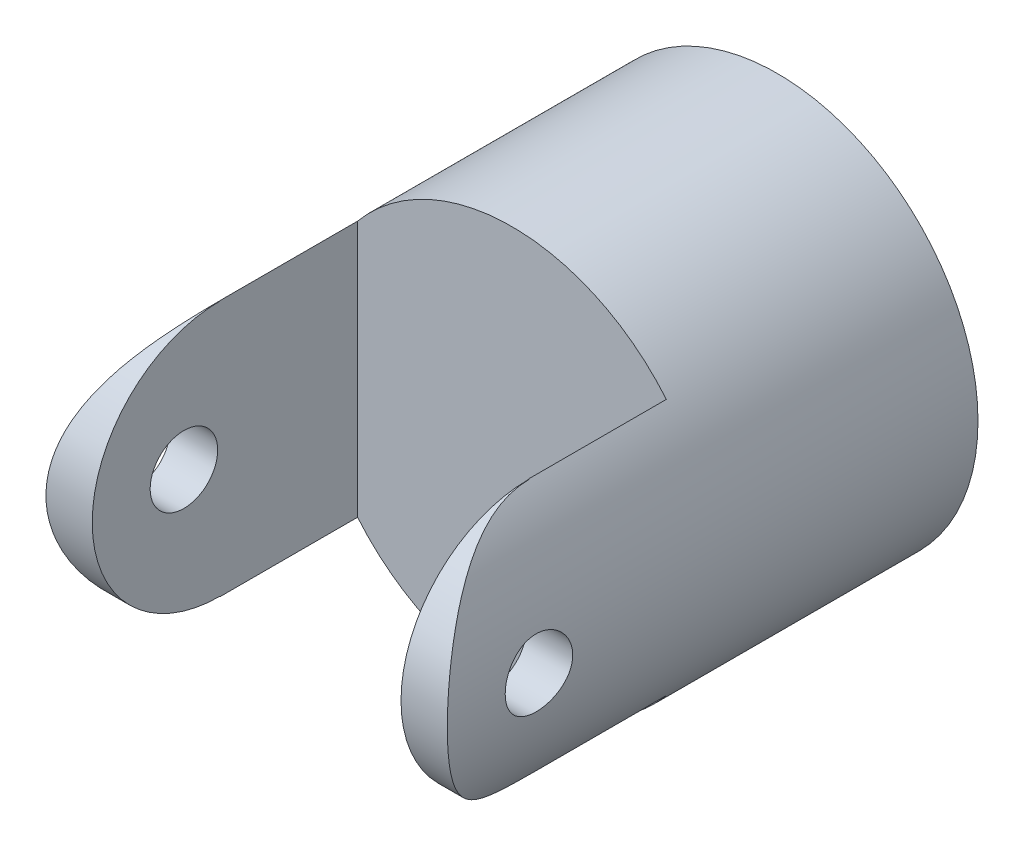
ISO-10303-21;
HEADER;
FILE_DESCRIPTION(('STEP AP214'),'2;1');
FILE_NAME('part.step','',(''),(''),'','','');
FILE_SCHEMA(('AUTOMOTIVE_DESIGN { 1 0 10303 214 1 1 1 1 }'));
ENDSEC;
DATA;
#1=APPLICATION_CONTEXT('core data for automotive mechanical design processes');
#2=APPLICATION_PROTOCOL_DEFINITION('international standard','automotive_design',2000,#1);
#3=PRODUCT_CONTEXT('',#1,'mechanical');
#4=PRODUCT('Part','Part','',(#3));
#5=PRODUCT_RELATED_PRODUCT_CATEGORY('part','',(#4));
#6=PRODUCT_DEFINITION_FORMATION('','',#4);
#7=PRODUCT_DEFINITION_CONTEXT('part definition',#1,'design');
#8=PRODUCT_DEFINITION('design','',#6,#7);
#9=PRODUCT_DEFINITION_SHAPE('','',#8);
#10=(LENGTH_UNIT() NAMED_UNIT(*) SI_UNIT(.MILLI.,.METRE.));
#11=(NAMED_UNIT(*) PLANE_ANGLE_UNIT() SI_UNIT($,.RADIAN.));
#12=(NAMED_UNIT(*) SI_UNIT($,.STERADIAN.) SOLID_ANGLE_UNIT());
#13=UNCERTAINTY_MEASURE_WITH_UNIT(LENGTH_MEASURE(1.E-05),#10,'distance_accuracy_value','');
#14=(GEOMETRIC_REPRESENTATION_CONTEXT(3) GLOBAL_UNCERTAINTY_ASSIGNED_CONTEXT((#13)) GLOBAL_UNIT_ASSIGNED_CONTEXT((#10,
#11,#12)) REPRESENTATION_CONTEXT('',''));
#15=CARTESIAN_POINT('',(0.,0.,0.));
#16=DIRECTION('',(0.,0.,1.));
#17=DIRECTION('',(1.,0.,0.));
#18=AXIS2_PLACEMENT_3D('',#15,#16,#17);
#19=CARTESIAN_POINT('',(0.,0.,11.));
#20=DIRECTION('',(0.,0.,-1.));
#21=DIRECTION('',(-1.,0.,0.));
#22=AXIS2_PLACEMENT_3D('',#19,#20,#21);
#23=CYLINDRICAL_SURFACE('',#22,4.16);
#24=CARTESIAN_POINT('',(-4.16,0.,8.4));
#25=CARTESIAN_POINT('',(-4.1599993277621,0.0390239125747628,8.40000155977883));
#26=CARTESIAN_POINT('',(-4.15944517372982,0.0780689849075887,8.4032743076211));
#27=CARTESIAN_POINT('',(-4.15728790947244,0.155063659220866,8.41627316724561));
#28=CARTESIAN_POINT('',(-4.1556838404645,0.193012226766777,8.42600517774355));
#29=CARTESIAN_POINT('',(-4.15160662871372,0.266688829253378,8.4516200868742));
#30=CARTESIAN_POINT('',(-4.1491342024726,0.302418666403529,8.46749791554888));
#31=CARTESIAN_POINT('',(-4.14359199062741,0.37070263465631,8.50494038987474));
#32=CARTESIAN_POINT('',(-4.14052227188301,0.403257120589323,8.52650439912268));
#33=CARTESIAN_POINT('',(-4.13409224580627,0.46458772784988,8.57493043107718));
#34=CARTESIAN_POINT('',(-4.13072963903228,0.493328446142046,8.6018369904627));
#35=CARTESIAN_POINT('',(-4.12411038432244,0.545909827859605,8.66008848698301));
#36=CARTESIAN_POINT('',(-4.12085374315079,0.569750178990013,8.69143370677385));
#37=CARTESIAN_POINT('',(-4.11479287163596,0.61199635700962,8.75791645283517));
#38=CARTESIAN_POINT('',(-4.11199161196014,0.630367102184491,8.79307656609853));
#39=CARTESIAN_POINT('',(-4.10719060804984,0.660928230525133,8.86603863677661));
#40=CARTESIAN_POINT('',(-4.10519080860076,0.673119039457476,8.90384041198986));
#41=CARTESIAN_POINT('',(-4.1022420557679,0.69086254711526,8.98063721227013));
#42=CARTESIAN_POINT('',(-4.10128342559077,0.696476412201096,9.01961772655558));
#43=CARTESIAN_POINT('',(-4.10049628461693,0.701096337075264,9.09797832626149));
#44=CARTESIAN_POINT('',(-4.10066769229779,0.700102873524991,9.13735838265381));
#45=CARTESIAN_POINT('',(-4.1021124270041,0.691586147504626,9.21496310071234));
#46=CARTESIAN_POINT('',(-4.10337414803079,0.68413165787628,9.25319555739738));
#47=CARTESIAN_POINT('',(-4.10683917312899,0.663012441156744,9.32785926339887));
#48=CARTESIAN_POINT('',(-4.10904251006289,0.649347497319705,9.3642904498015));
#49=CARTESIAN_POINT('',(-4.11415501382972,0.616125724703303,9.43452301139548));
#50=CARTESIAN_POINT('',(-4.11706758136741,0.596540395518846,9.46831064744649));
#51=CARTESIAN_POINT('',(-4.12326802042378,0.552054037069553,9.53214599064827));
#52=CARTESIAN_POINT('',(-4.12655592279497,0.527152570671694,9.56219338992663));
#53=CARTESIAN_POINT('',(-4.13318753266133,0.47236637629369,9.61809336013438));
#54=CARTESIAN_POINT('',(-4.13653142033276,0.442422655344115,9.64388812707109));
#55=CARTESIAN_POINT('',(-4.14285984072331,0.37860130707401,9.69009584686133));
#56=CARTESIAN_POINT('',(-4.14584437104319,0.344723653491564,9.71050876378405));
#57=CARTESIAN_POINT('',(-4.1511221620187,0.273941318469586,9.74537883203141));
#58=CARTESIAN_POINT('',(-4.15341482187015,0.237034041344438,9.75983081098754));
#59=CARTESIAN_POINT('',(-4.1570457409022,0.161268902511086,9.78231477164084));
#60=CARTESIAN_POINT('',(-4.15838408148438,0.122411207472467,9.7903473009117));
#61=CARTESIAN_POINT('',(-4.15994460407459,0.0443464102274835,9.79968583493131));
#62=CARTESIAN_POINT('',(-4.16017995079601,0.00514905333311402,9.80107118148655));
#63=CARTESIAN_POINT('',(-4.1595440480163,-0.0729176566416257,9.79728764814687));
#64=CARTESIAN_POINT('',(-4.15867284194514,-0.111787022534712,9.79211902548208));
#65=CARTESIAN_POINT('',(-4.15592987811917,-0.187848839546986,9.77544026231971));
#66=CARTESIAN_POINT('',(-4.15406433008375,-0.225050161244746,9.76396946569981));
#67=CARTESIAN_POINT('',(-4.14954102253772,-0.297001702403252,9.73505395660164));
#68=CARTESIAN_POINT('',(-4.14688321783,-0.331751781884226,9.71760890329211));
#69=CARTESIAN_POINT('',(-4.14103756729968,-0.398158605742829,9.67705881107004));
#70=CARTESIAN_POINT('',(-4.13784517038284,-0.429784726143966,9.6539042896113));
#71=CARTESIAN_POINT('',(-4.13129802571993,-0.488730817092044,9.60266051997944));
#72=CARTESIAN_POINT('',(-4.12794326595238,-0.516050468145263,9.57457090600211));
#73=CARTESIAN_POINT('',(-4.12140684889181,-0.565902760035183,9.51389821469653));
#74=CARTESIAN_POINT('',(-4.11822739594523,-0.588381753338073,9.4812707822775));
#75=CARTESIAN_POINT('',(-4.11244297967972,-0.62753977754453,9.41265632538366));
#76=CARTESIAN_POINT('',(-4.10983799789771,-0.6442189948586,9.37666940893314));
#77=CARTESIAN_POINT('',(-4.1055140656407,-0.671224072877987,9.30250651334735));
#78=CARTESIAN_POINT('',(-4.10379141775969,-0.681576481831249,9.26434042661519));
#79=CARTESIAN_POINT('',(-4.10141798088834,-0.695717505748562,9.18677960808961));
#80=CARTESIAN_POINT('',(-4.10076709673286,-0.699506703481541,9.14738498569812));
#81=CARTESIAN_POINT('',(-4.10061503803945,-0.70039725202405,9.06902118945909));
#82=CARTESIAN_POINT('',(-4.10109934457034,-0.697583058792982,9.0300529778608));
#83=CARTESIAN_POINT('',(-4.10313125058084,-0.685529497995793,8.9531529833514));
#84=CARTESIAN_POINT('',(-4.10467884642083,-0.676290152422942,8.91522119689308));
#85=CARTESIAN_POINT('',(-4.10865739445353,-0.651681156604191,8.84150439132123));
#86=CARTESIAN_POINT('',(-4.11108727872626,-0.636318915311279,8.80571683758478));
#87=CARTESIAN_POINT('',(-4.11655762981038,-0.599908920025351,8.73721334940979));
#88=CARTESIAN_POINT('',(-4.1195981278615,-0.578860875120836,8.70449757225273));
#89=CARTESIAN_POINT('',(-4.12599307843607,-0.531375902753995,8.64263988511162));
#90=CARTESIAN_POINT('',(-4.12935088277078,-0.504876889588195,8.61354597472536));
#91=CARTESIAN_POINT('',(-4.13597549546759,-0.447373004296234,8.56018888428044));
#92=CARTESIAN_POINT('',(-4.13924228266241,-0.416367094283321,8.53592681999919));
#93=CARTESIAN_POINT('',(-4.14534350893309,-0.350469460605587,8.49276545794503));
#94=CARTESIAN_POINT('',(-4.14817473607019,-0.315551872090762,8.47390519165113));
#95=CARTESIAN_POINT('',(-4.15305458015047,-0.243010434628081,8.44234710952398));
#96=CARTESIAN_POINT('',(-4.15510397288708,-0.205389312618788,8.42964318151871));
#97=CARTESIAN_POINT('',(-4.15774414448338,-0.139687071677165,8.41350289017298));
#98=CARTESIAN_POINT('',(-4.15858555014462,-0.112002502096261,8.40844745508329));
#99=CARTESIAN_POINT('',(-4.15971371512396,-0.0562156106525505,8.40169547796901));
#100=CARTESIAN_POINT('',(-4.16000048428827,-0.028113296214703,8.39999887631656));
#101=CARTESIAN_POINT('',(-4.16,0.,8.4));
#102=B_SPLINE_CURVE_WITH_KNOTS('',3,(#24,#25,#26,#27,#28,#29,#30,#31,#32,#33,#34,#35,#36,#37,
#38,#39,#40,#41,#42,#43,#44,#45,#46,#47,#48,#49,#50,#51,#52,#53,#54,#55,#56,#57,#58,#59,#60,#61,
#62,#63,#64,#65,#66,#67,#68,#69,#70,#71,#72,#73,#74,#75,#76,#77,#78,#79,#80,#81,#82,#83,#84,#85,
#86,#87,#88,#89,#90,#91,#92,#93,#94,#95,#96,#97,#98,#99,#100,#101),.UNSPECIFIED.,.T.,.F.,(4,2,2,
2,2,2,2,2,2,2,2,2,2,2,2,2,2,2,2,2,2,2,2,2,2,2,2,2,2,2,2,2,2,2,2,2,2,2,4),(0.,0.116968971867076,
0.234044909163309,0.351024470460435,0.467990944836635,0.585976836802057,0.703970245548359,
0.82270491376216,0.941431400641504,1.05904472417866,1.1766495630277,1.29301774815333,
1.40938999485922,1.52633162208068,1.6432828688337,1.76171192378295,1.88014176937935,
1.99867416270379,2.11719644423498,2.23430044546542,2.35139985074145,2.46777638798962,
2.58415956562407,2.70158922800758,2.81902759831333,2.93770721667888,3.05638302021214,
3.17455736019733,3.29272120655945,3.409382015381,3.52604242487508,3.64256209702446,
3.75908773197823,3.87702241655098,3.99498430328666,4.11377819537088,4.23245390293315,
4.31672125379096,4.4009871086749),.UNSPECIFIED.);
#103=CARTESIAN_POINT('',(-4.16,0.,8.4));
#104=VERTEX_POINT('',#103);
#105=EDGE_CURVE('E132',#104,#104,#102,.T.);
#106=ORIENTED_EDGE('',*,*,#105,.T.);
#107=EDGE_LOOP('',(#106));
#108=FACE_BOUND('',#107,.T.);
#109=CARTESIAN_POINT('',(4.16,0.,8.4));
#110=CARTESIAN_POINT('',(4.1599993277621,-0.0390239125747628,8.40000155977883));
#111=CARTESIAN_POINT('',(4.15944517372982,-0.0780689849075887,8.4032743076211));
#112=CARTESIAN_POINT('',(4.15728790947244,-0.155063659220866,8.41627316724561));
#113=CARTESIAN_POINT('',(4.1556838404645,-0.193012226766777,8.42600517774355));
#114=CARTESIAN_POINT('',(4.15160662871372,-0.266688829253378,8.4516200868742));
#115=CARTESIAN_POINT('',(4.1491342024726,-0.302418666403529,8.46749791554888));
#116=CARTESIAN_POINT('',(4.14359199062741,-0.37070263465631,8.50494038987474));
#117=CARTESIAN_POINT('',(4.14052227188301,-0.403257120589323,8.52650439912268));
#118=CARTESIAN_POINT('',(4.13409224580627,-0.46458772784988,8.57493043107718));
#119=CARTESIAN_POINT('',(4.13072963903228,-0.493328446142046,8.6018369904627));
#120=CARTESIAN_POINT('',(4.12411038432244,-0.545909827859605,8.66008848698301));
#121=CARTESIAN_POINT('',(4.12085374315079,-0.569750178990013,8.69143370677385));
#122=CARTESIAN_POINT('',(4.11479287163596,-0.61199635700962,8.75791645283517));
#123=CARTESIAN_POINT('',(4.11199161196014,-0.630367102184491,8.79307656609853));
#124=CARTESIAN_POINT('',(4.10719060804984,-0.660928230525133,8.86603863677661));
#125=CARTESIAN_POINT('',(4.10519080860076,-0.673119039457476,8.90384041198986));
#126=CARTESIAN_POINT('',(4.1022420557679,-0.69086254711526,8.98063721227013));
#127=CARTESIAN_POINT('',(4.10128342559077,-0.696476412201096,9.01961772655558));
#128=CARTESIAN_POINT('',(4.10049628461693,-0.701096337075264,9.09797832626149));
#129=CARTESIAN_POINT('',(4.10066769229779,-0.700102873524991,9.13735838265381));
#130=CARTESIAN_POINT('',(4.1021124270041,-0.691586147504626,9.21496310071234));
#131=CARTESIAN_POINT('',(4.10337414803079,-0.68413165787628,9.25319555739738));
#132=CARTESIAN_POINT('',(4.10683917312899,-0.663012441156744,9.32785926339887));
#133=CARTESIAN_POINT('',(4.10904251006289,-0.649347497319705,9.3642904498015));
#134=CARTESIAN_POINT('',(4.11415501382972,-0.616125724703303,9.43452301139548));
#135=CARTESIAN_POINT('',(4.11706758136741,-0.596540395518846,9.46831064744649));
#136=CARTESIAN_POINT('',(4.12326802042378,-0.552054037069553,9.53214599064827));
#137=CARTESIAN_POINT('',(4.12655592279497,-0.527152570671694,9.56219338992663));
#138=CARTESIAN_POINT('',(4.13318753266133,-0.47236637629369,9.61809336013438));
#139=CARTESIAN_POINT('',(4.13653142033276,-0.442422655344115,9.64388812707109));
#140=CARTESIAN_POINT('',(4.14285984072331,-0.37860130707401,9.69009584686133));
#141=CARTESIAN_POINT('',(4.14584437104319,-0.344723653491564,9.71050876378405));
#142=CARTESIAN_POINT('',(4.1511221620187,-0.273941318469586,9.74537883203141));
#143=CARTESIAN_POINT('',(4.15341482187015,-0.237034041344438,9.75983081098754));
#144=CARTESIAN_POINT('',(4.1570457409022,-0.161268902511086,9.78231477164084));
#145=CARTESIAN_POINT('',(4.15838408148438,-0.122411207472467,9.7903473009117));
#146=CARTESIAN_POINT('',(4.15994460407459,-0.0443464102274835,9.79968583493131));
#147=CARTESIAN_POINT('',(4.16017995079601,-0.00514905333311402,9.80107118148655));
#148=CARTESIAN_POINT('',(4.1595440480163,0.0729176566416257,9.79728764814687));
#149=CARTESIAN_POINT('',(4.15867284194514,0.111787022534712,9.79211902548208));
#150=CARTESIAN_POINT('',(4.15592987811917,0.187848839546986,9.77544026231971));
#151=CARTESIAN_POINT('',(4.15406433008375,0.225050161244746,9.76396946569981));
#152=CARTESIAN_POINT('',(4.14954102253772,0.297001702403252,9.73505395660164));
#153=CARTESIAN_POINT('',(4.14688321783,0.331751781884226,9.71760890329211));
#154=CARTESIAN_POINT('',(4.14103756729968,0.398158605742829,9.67705881107004));
#155=CARTESIAN_POINT('',(4.13784517038284,0.429784726143966,9.6539042896113));
#156=CARTESIAN_POINT('',(4.13129802571993,0.488730817092044,9.60266051997944));
#157=CARTESIAN_POINT('',(4.12794326595238,0.516050468145263,9.57457090600211));
#158=CARTESIAN_POINT('',(4.12140684889181,0.565902760035183,9.51389821469653));
#159=CARTESIAN_POINT('',(4.11822739594523,0.588381753338073,9.4812707822775));
#160=CARTESIAN_POINT('',(4.11244297967972,0.62753977754453,9.41265632538366));
#161=CARTESIAN_POINT('',(4.10983799789771,0.6442189948586,9.37666940893314));
#162=CARTESIAN_POINT('',(4.1055140656407,0.671224072877987,9.30250651334735));
#163=CARTESIAN_POINT('',(4.10379141775969,0.681576481831249,9.26434042661519));
#164=CARTESIAN_POINT('',(4.10141798088834,0.695717505748562,9.18677960808961));
#165=CARTESIAN_POINT('',(4.10076709673286,0.699506703481541,9.14738498569812));
#166=CARTESIAN_POINT('',(4.10061503803945,0.70039725202405,9.06902118945909));
#167=CARTESIAN_POINT('',(4.10109934457034,0.697583058792982,9.0300529778608));
#168=CARTESIAN_POINT('',(4.10313125058084,0.685529497995793,8.9531529833514));
#169=CARTESIAN_POINT('',(4.10467884642083,0.676290152422942,8.91522119689308));
#170=CARTESIAN_POINT('',(4.10865739445353,0.651681156604191,8.84150439132123));
#171=CARTESIAN_POINT('',(4.11108727872626,0.636318915311279,8.80571683758478));
#172=CARTESIAN_POINT('',(4.11655762981038,0.599908920025351,8.73721334940979));
#173=CARTESIAN_POINT('',(4.1195981278615,0.578860875120836,8.70449757225273));
#174=CARTESIAN_POINT('',(4.12599307843607,0.531375902753995,8.64263988511162));
#175=CARTESIAN_POINT('',(4.12935088277078,0.504876889588195,8.61354597472536));
#176=CARTESIAN_POINT('',(4.13597549546759,0.447373004296234,8.56018888428044));
#177=CARTESIAN_POINT('',(4.13924228266241,0.416367094283321,8.53592681999919));
#178=CARTESIAN_POINT('',(4.14534350893309,0.350469460605587,8.49276545794503));
#179=CARTESIAN_POINT('',(4.14817473607019,0.315551872090762,8.47390519165113));
#180=CARTESIAN_POINT('',(4.15305458015047,0.243010434628081,8.44234710952398));
#181=CARTESIAN_POINT('',(4.15510397288708,0.205389312618788,8.42964318151871));
#182=CARTESIAN_POINT('',(4.15774414448338,0.139687071677165,8.41350289017298));
#183=CARTESIAN_POINT('',(4.15858555014462,0.112002502096261,8.40844745508329));
#184=CARTESIAN_POINT('',(4.15971371512396,0.0562156106525505,8.40169547796901));
#185=CARTESIAN_POINT('',(4.16000048428827,0.028113296214703,8.39999887631656));
#186=CARTESIAN_POINT('',(4.16,0.,8.4));
#187=B_SPLINE_CURVE_WITH_KNOTS('',3,(#109,#110,#111,#112,#113,#114,#115,#116,#117,#118,#119,
#120,#121,#122,#123,#124,#125,#126,#127,#128,#129,#130,#131,#132,#133,#134,#135,#136,#137,#138,
#139,#140,#141,#142,#143,#144,#145,#146,#147,#148,#149,#150,#151,#152,#153,#154,#155,#156,#157,
#158,#159,#160,#161,#162,#163,#164,#165,#166,#167,#168,#169,#170,#171,#172,#173,#174,#175,#176,
#177,#178,#179,#180,#181,#182,#183,#184,#185,#186),.UNSPECIFIED.,.T.,.F.,(4,2,2,2,2,2,2,2,2,2,2,
2,2,2,2,2,2,2,2,2,2,2,2,2,2,2,2,2,2,2,2,2,2,2,2,2,2,2,4),(0.,0.116968971867076,
0.234044909163309,0.351024470460435,0.467990944836635,0.585976836802057,0.703970245548359,
0.82270491376216,0.941431400641504,1.05904472417866,1.1766495630277,1.29301774815333,
1.40938999485922,1.52633162208068,1.6432828688337,1.76171192378295,1.88014176937935,
1.99867416270379,2.11719644423498,2.23430044546542,2.35139985074145,2.46777638798962,
2.58415956562407,2.70158922800758,2.81902759831333,2.93770721667888,3.05638302021214,
3.17455736019733,3.29272120655945,3.409382015381,3.52604242487508,3.64256209702446,
3.75908773197823,3.87702241655098,3.99498430328666,4.11377819537088,4.23245390293315,
4.31672125379096,4.4009871086749),.UNSPECIFIED.);
#188=CARTESIAN_POINT('',(4.16,0.,8.4));
#189=VERTEX_POINT('',#188);
#190=EDGE_CURVE('E139',#189,#189,#187,.T.);
#191=ORIENTED_EDGE('',*,*,#190,.T.);
#192=EDGE_LOOP('',(#191));
#193=FACE_BOUND('',#192,.T.);
#194=DIRECTION('',(0.,0.,-1.));
#195=VECTOR('',#194,1.);
#196=CARTESIAN_POINT('',(3.2,2.65811963613378,11.));
#197=LINE('',#196,#195);
#198=CARTESIAN_POINT('',(3.2,2.65811963613378,5.5));
#199=VERTEX_POINT('',#198);
#200=CARTESIAN_POINT('',(3.2,2.65811963613378,8.35));
#201=VERTEX_POINT('',#200);
#202=EDGE_CURVE('E183',#199,#201,#197,.F.);
#203=ORIENTED_EDGE('',*,*,#202,.T.);
#204=CARTESIAN_POINT('',(0.,0.,8.35));
#205=DIRECTION('',(0.,0.,-1.));
#206=DIRECTION('',(-1.,0.,0.));
#207=AXIS2_PLACEMENT_3D('',#204,#205,#206);
#208=CIRCLE('',#207,4.16);
#209=CARTESIAN_POINT('',(3.20672730365399,2.65,8.35));
#210=VERTEX_POINT('',#209);
#211=EDGE_CURVE('E108',#201,#210,#208,.T.);
#212=ORIENTED_EDGE('',*,*,#211,.T.);
#213=CARTESIAN_POINT('',(3.20672730365399,2.65,8.35));
#214=CARTESIAN_POINT('',(3.20669505811809,2.6500160283953,8.41600762728984));
#215=CARTESIAN_POINT('',(3.20876451539116,2.64753446292586,8.48199574117056));
#216=CARTESIAN_POINT('',(3.21686000468512,2.63770436351235,8.6132897334531));
#217=CARTESIAN_POINT('',(3.22288144484862,2.63036147790947,8.67859631438047));
#218=CARTESIAN_POINT('',(3.23856426362669,2.61102379201802,8.8074575561479));
#219=CARTESIAN_POINT('',(3.24819241085993,2.59907143356764,8.87102269200466));
#220=CARTESIAN_POINT('',(3.27067722024509,2.57071954376607,8.99656510040091));
#221=CARTESIAN_POINT('',(3.28353467768257,2.55431891685561,9.05854197764881));
#222=CARTESIAN_POINT('',(3.32611454748676,2.49894471907308,9.24098633080575));
#223=CARTESIAN_POINT('',(3.35993644993818,2.45369268273078,9.35865168939531));
#224=CARTESIAN_POINT('',(3.43457647325418,2.34807721097754,9.58478456622257));
#225=CARTESIAN_POINT('',(3.47541252786229,2.28767485244232,9.69322741462268));
#226=CARTESIAN_POINT('',(3.56626107151885,2.14373021273325,9.91416620206438));
#227=CARTESIAN_POINT('',(3.61676021769055,2.05813888489881,10.0251318104465));
#228=CARTESIAN_POINT('',(3.71728722279422,1.87049295958019,10.2323745995469));
#229=CARTESIAN_POINT('',(3.76731489010916,1.76843195013416,10.3286460310212));
#230=CARTESIAN_POINT('',(3.86884717703238,1.5348454058189,10.5160688473868));
#231=CARTESIAN_POINT('',(3.91972805251957,1.40122264248246,10.6050055882579));
#232=CARTESIAN_POINT('',(3.98736678964662,1.18831579844764,10.7200076573631));
#233=CARTESIAN_POINT('',(4.00847126438806,1.11524286278054,10.7552827883369));
#234=CARTESIAN_POINT('',(4.04716932801902,0.965395181767101,10.8192372236001));
#235=CARTESIAN_POINT('',(4.06476539462032,0.888623096755101,10.8479211849109));
#236=CARTESIAN_POINT('',(4.09424894951388,0.740165723076318,10.8956013634813));
#237=CARTESIAN_POINT('',(4.10654021793189,0.66878394332158,10.9152955999517));
#238=CARTESIAN_POINT('',(4.1274934437329,0.524149274703781,10.9487057885936));
#239=CARTESIAN_POINT('',(4.13615753349387,0.450897512134977,10.9624252534582));
#240=CARTESIAN_POINT('',(4.14959852568186,0.303189053306739,10.9836545651541));
#241=CARTESIAN_POINT('',(4.1543779963417,0.228733186382834,10.9911685146823));
#242=CARTESIAN_POINT('',(4.1599167354821,0.0793302960709673,10.9998707866687));
#243=CARTESIAN_POINT('',(4.16067649481135,0.00438333376997673,11.0010598814578));
#244=CARTESIAN_POINT('',(4.15721299561737,-0.199206688897612,10.9956282507606));
#245=CARTESIAN_POINT('',(4.14901150521583,-0.327688754379458,10.9827733557036));
#246=CARTESIAN_POINT('',(4.12131045618796,-0.580151905277748,10.9388954717403));
#247=CARTESIAN_POINT('',(4.10180999423465,-0.704132629980009,10.9078710302181));
#248=CARTESIAN_POINT('',(4.05316605362649,-0.944735368137761,10.8291156027387));
#249=CARTESIAN_POINT('',(4.02401422814085,-1.06135090761252,10.7813701538064));
#250=CARTESIAN_POINT('',(3.95829117182254,-1.28496546345559,10.6709765815365));
#251=CARTESIAN_POINT('',(3.92171885331419,-1.3919630667314,10.6083262732527));
#252=CARTESIAN_POINT('',(3.83867583176293,-1.60784718202649,10.4610422617027));
#253=CARTESIAN_POINT('',(3.79153825590707,-1.7152617391232,10.3746305218407));
#254=CARTESIAN_POINT('',(3.69466426676838,-1.9150511808397,10.186823635248));
#255=CARTESIAN_POINT('',(3.64492307670927,-2.00739704388281,10.0854002765597));
#256=CARTESIAN_POINT('',(3.54020951927387,-2.18741463652778,9.85403254771881));
#257=CARTESIAN_POINT('',(3.48546866291426,-2.27266094269475,9.72208345679977));
#258=CARTESIAN_POINT('',(3.38529956286428,-2.41934756100157,9.44267970306101));
#259=CARTESIAN_POINT('',(3.33983524936024,-2.48088093909605,9.29528860523034));
#260=CARTESIAN_POINT('',(3.28801692378069,-2.54855896361415,9.0791554870462));
#261=CARTESIAN_POINT('',(3.2744440105472,-2.56592756537774,9.0155136448719));
#262=CARTESIAN_POINT('',(3.25068197969008,-2.5959646101103,8.88651346554289));
#263=CARTESIAN_POINT('',(3.24049146008133,-2.60863500071993,8.82115585171927));
#264=CARTESIAN_POINT('',(3.22387519894656,-2.62914734735592,8.68855789981288));
#265=CARTESIAN_POINT('',(3.21748644109494,-2.63694190737749,8.6213055264091));
#266=CARTESIAN_POINT('',(3.20889148108242,-2.64738082111482,8.48604368824188));
#267=CARTESIAN_POINT('',(3.20669125515124,-2.65001781612364,8.41803328076841));
#268=CARTESIAN_POINT('',(3.20672730365399,-2.65,8.35));
#269=B_SPLINE_CURVE_WITH_KNOTS('',3,(#213,#214,#215,#216,#217,#218,#219,#220,#221,#222,#223,
#224,#225,#226,#227,#228,#229,#230,#231,#232,#233,#234,#235,#236,#237,#238,#239,#240,#241,#242,
#243,#244,#245,#246,#247,#248,#249,#250,#251,#252,#253,#254,#255,#256,#257,#258,#259,#260,#261,
#262,#263,#264,#265,#266,#267,#268),.UNSPECIFIED.,.F.,.F.,(4,2,2,2,2,2,2,2,2,2,2,2,2,2,2,2,2,2,
2,2,2,2,2,2,2,2,2,4),(0.,0.197912306414299,0.395595062230328,0.591499506597758,
0.787452243942295,1.17728912478481,1.56813799322805,2.01329217126134,2.45862007630531,
2.96067962611412,3.21186909182646,3.46288052896882,3.68773681749321,3.91246072924424,
4.1370359484587,4.36158374406302,4.74768030588197,5.13380773949987,5.5202699855289,
5.90678891911809,6.34218253133714,6.77840503827903,7.27514024766802,7.7699055719821,
7.97174320317075,8.17349706889667,8.37718281200512,8.58115895832141),.UNSPECIFIED.);
#270=CARTESIAN_POINT('',(3.20672730365399,-2.65,8.35));
#271=VERTEX_POINT('',#270);
#272=EDGE_CURVE('E109',#210,#271,#269,.T.);
#273=ORIENTED_EDGE('',*,*,#272,.T.);
#274=CARTESIAN_POINT('',(0.,0.,8.35));
#275=DIRECTION('',(0.,0.,-1.));
#276=DIRECTION('',(-1.,0.,0.));
#277=AXIS2_PLACEMENT_3D('',#274,#275,#276);
#278=CIRCLE('',#277,4.16);
#279=CARTESIAN_POINT('',(3.2,-2.65811963613378,8.35));
#280=VERTEX_POINT('',#279);
#281=EDGE_CURVE('E122',#271,#280,#278,.T.);
#282=ORIENTED_EDGE('',*,*,#281,.T.);
#283=DIRECTION('',(0.,0.,-1.));
#284=VECTOR('',#283,1.);
#285=CARTESIAN_POINT('',(3.2,-2.65811963613378,11.));
#286=LINE('',#285,#284);
#287=CARTESIAN_POINT('',(3.2,-2.65811963613378,5.5));
#288=VERTEX_POINT('',#287);
#289=EDGE_CURVE('E188',#280,#288,#286,.T.);
#290=ORIENTED_EDGE('',*,*,#289,.T.);
#291=CARTESIAN_POINT('',(0.,0.,5.5));
#292=DIRECTION('',(0.,0.,-1.));
#293=DIRECTION('',(-1.,0.,0.));
#294=AXIS2_PLACEMENT_3D('',#291,#292,#293);
#295=CIRCLE('',#294,4.16);
#296=CARTESIAN_POINT('',(-3.2,-2.65811963613378,5.5));
#297=VERTEX_POINT('',#296);
#298=EDGE_CURVE('E199',#288,#297,#295,.T.);
#299=ORIENTED_EDGE('',*,*,#298,.T.);
#300=DIRECTION('',(0.,0.,-1.));
#301=VECTOR('',#300,1.);
#302=CARTESIAN_POINT('',(-3.2,-2.65811963613378,11.));
#303=LINE('',#302,#301);
#304=CARTESIAN_POINT('',(-3.2,-2.65811963613378,8.35));
#305=VERTEX_POINT('',#304);
#306=EDGE_CURVE('E119',#297,#305,#303,.F.);
#307=ORIENTED_EDGE('',*,*,#306,.T.);
#308=CARTESIAN_POINT('',(-3.20672730365399,-2.65,8.35));
#309=VERTEX_POINT('',#308);
#310=EDGE_CURVE('E47',#305,#309,#278,.T.);
#311=ORIENTED_EDGE('',*,*,#310,.T.);
#312=CARTESIAN_POINT('',(-3.20672730365399,-2.65,8.35));
#313=CARTESIAN_POINT('',(-3.2066950569446,-2.65001603233073,8.41600786618289));
#314=CARTESIAN_POINT('',(-3.20876452986633,-2.6475344468261,8.48199622095595));
#315=CARTESIAN_POINT('',(-3.21686007840042,-2.63770427239442,8.61329068726936));
#316=CARTESIAN_POINT('',(-3.22288156206535,-2.63036133191998,8.67859750135164));
#317=CARTESIAN_POINT('',(-3.23856443279243,-2.61102358495306,8.80745872341925));
#318=CARTESIAN_POINT('',(-3.24819256173721,-2.59907125438728,8.87102361493784));
#319=CARTESIAN_POINT('',(-3.27067731712963,-2.5707194105278,8.99656556076683));
#320=CARTESIAN_POINT('',(-3.2835347388135,-2.55431880173449,9.0585422198147));
#321=CARTESIAN_POINT('',(-3.32611457476561,-2.49894475446523,9.24098648701093));
#322=CARTESIAN_POINT('',(-3.35993646170183,-2.45369304916129,9.35865186754687));
#323=CARTESIAN_POINT('',(-3.43457669832319,-2.34807650845614,9.58478510498086));
#324=CARTESIAN_POINT('',(-3.47541296077156,-2.28767279258207,9.69322832394361));
#325=CARTESIAN_POINT('',(-3.56625955812675,-2.14373417542528,9.91416268500063));
#326=CARTESIAN_POINT('',(-3.61675627016061,-2.0581516201372,10.0251233979166));
#327=CARTESIAN_POINT('',(-3.71728660122356,-1.87048875196189,10.2323735925183));
#328=CARTESIAN_POINT('',(-3.76732000894074,-1.76840126866439,10.3286566621578));
#329=CARTESIAN_POINT('',(-3.8688492910669,-1.53486185874963,10.5160714169269));
#330=CARTESIAN_POINT('',(-3.91971761678179,-1.40132533167105,10.6049793697717));
#331=CARTESIAN_POINT('',(-4.00989192119378,-1.1173435286487,10.7583142524245));
#332=CARTESIAN_POINT('',(-4.04921277108696,-0.966920348216277,10.8227727005503));
#333=CARTESIAN_POINT('',(-4.10598842074772,-0.681066195574498,10.9145838034583));
#334=CARTESIAN_POINT('',(-4.1260630588641,-0.547606621993921,10.9464514106566));
#335=CARTESIAN_POINT('',(-4.15306256562993,-0.276091731297322,10.9891499003433));
#336=CARTESIAN_POINT('',(-4.15999800756453,-0.138040200507549,10.9999976979112));
#337=CARTESIAN_POINT('',(-4.16000193935794,0.134362875325561,11.0000022407623));
#338=CARTESIAN_POINT('',(-4.15343491637915,0.268715015994844,10.9897291270513));
#339=CARTESIAN_POINT('',(-4.12783259780039,0.533163012478475,10.9492585268422));
#340=CARTESIAN_POINT('',(-4.10879262488342,0.66325725237042,10.9190535659328));
#341=CARTESIAN_POINT('',(-4.06013823412719,0.915023056300292,10.8404949745796));
#342=CARTESIAN_POINT('',(-4.0305701571117,1.0367287848497,10.7922208310381));
#343=CARTESIAN_POINT('',(-3.96329579799949,1.26989365901362,10.6795181501988));
#344=CARTESIAN_POINT('',(-3.92558868360515,1.38135175504229,10.6150879606754));
#345=CARTESIAN_POINT('',(-3.8415043235843,1.60105499277028,10.4661628419323));
#346=CARTESIAN_POINT('',(-3.79467192621944,1.70830638298094,10.3804643891463));
#347=CARTESIAN_POINT('',(-3.6983459740994,1.90791855907305,10.1941862081327));
#348=CARTESIAN_POINT('',(-3.64884786884299,2.0002527322788,10.0935804846254));
#349=CARTESIAN_POINT('',(-3.54431232561143,2.18077977305783,9.8636200954213));
#350=CARTESIAN_POINT('',(-3.48949306427323,2.26649898089916,9.7322116169376));
#351=CARTESIAN_POINT('',(-3.38894825584364,2.41425361264903,9.453860852767));
#352=CARTESIAN_POINT('',(-3.34318836242538,2.4763793417481,9.30698060265994));
#353=CARTESIAN_POINT('',(-3.29052405428252,2.54532856298086,9.09044275214302));
#354=CARTESIAN_POINT('',(-3.27655217465774,2.56323955814269,9.02589410258745));
#355=CARTESIAN_POINT('',(-3.25207648674413,2.59422181579563,8.89500400208282));
#356=CARTESIAN_POINT('',(-3.2415712138379,2.60729512246083,8.82866332110424));
#357=CARTESIAN_POINT('',(-3.22443216118824,2.62846658002187,8.69401504794051));
#358=CARTESIAN_POINT('',(-3.21783735754271,2.63651468478133,8.62569454704852));
#359=CARTESIAN_POINT('',(-3.2089625245374,2.64729484638864,8.48825826349253));
#360=CARTESIAN_POINT('',(-3.20668894286933,2.65001895948402,8.41914144698602));
#361=CARTESIAN_POINT('',(-3.20672730365399,2.65,8.35));
#362=B_SPLINE_CURVE_WITH_KNOTS('',3,(#312,#313,#314,#315,#316,#317,#318,#319,#320,#321,#322,
#323,#324,#325,#326,#327,#328,#329,#330,#331,#332,#333,#334,#335,#336,#337,#338,#339,#340,#341,
#342,#343,#344,#345,#346,#347,#348,#349,#350,#351,#352,#353,#354,#355,#356,#357,#358,#359,#360,
#361),.UNSPECIFIED.,.F.,.F.,(4,2,2,2,2,2,2,2,2,2,2,2,2,2,2,2,2,2,2,2,2,2,2,2,4),(0.,
0.19791302635126,0.395596498391126,0.591500226042087,0.787452243756272,1.17728974135386,
1.56813799281474,2.01328207878496,2.45862007564806,2.96076458630949,3.46225955502895,
3.87614858071767,4.28970440272061,4.69224329463494,5.09493322384377,5.49587213783643,
5.89685207126567,6.33035331513185,6.76461959349507,7.26089080684145,7.75524290024823,
7.96030445067044,8.16527925274726,8.37226414197891,8.5795576314723),.UNSPECIFIED.);
#363=CARTESIAN_POINT('',(-3.20672730365399,2.65,8.35));
#364=VERTEX_POINT('',#363);
#365=EDGE_CURVE('E101',#309,#364,#362,.T.);
#366=ORIENTED_EDGE('',*,*,#365,.T.);
#367=CARTESIAN_POINT('',(-3.2,2.65811963613378,8.35));
#368=VERTEX_POINT('',#367);
#369=EDGE_CURVE('E178',#364,#368,#208,.T.);
#370=ORIENTED_EDGE('',*,*,#369,.T.);
#371=DIRECTION('',(0.,0.,-1.));
#372=VECTOR('',#371,1.);
#373=CARTESIAN_POINT('',(-3.2,2.65811963613378,11.));
#374=LINE('',#373,#372);
#375=CARTESIAN_POINT('',(-3.2,2.65811963613378,5.5));
#376=VERTEX_POINT('',#375);
#377=EDGE_CURVE('E191',#368,#376,#374,.T.);
#378=ORIENTED_EDGE('',*,*,#377,.T.);
#379=EDGE_CURVE('E196',#376,#199,#295,.T.);
#380=ORIENTED_EDGE('',*,*,#379,.T.);
#381=EDGE_LOOP('',(#203,#212,#273,#282,#290,#299,#307,#311,#366,#370,#378,#380));
#382=FACE_BOUND('',#381,.T.);
#383=CARTESIAN_POINT('',(0.,0.,0.));
#384=DIRECTION('',(0.,0.,1.));
#385=DIRECTION('',(1.,0.,0.));
#386=AXIS2_PLACEMENT_3D('',#383,#384,#385);
#387=CIRCLE('',#386,4.16);
#388=CARTESIAN_POINT('',(4.16,0.,0.));
#389=VERTEX_POINT('',#388);
#390=EDGE_CURVE('E193',#389,#389,#387,.T.);
#391=ORIENTED_EDGE('',*,*,#390,.T.);
#392=EDGE_LOOP('',(#391));
#393=FACE_BOUND('',#392,.T.);
#394=ADVANCED_FACE('F31',(#108,#193,#382,#393),#23,.T.);
#395=CARTESIAN_POINT('',(0.,0.,0.));
#396=DIRECTION('',(0.,0.,1.));
#397=DIRECTION('',(1.,0.,0.));
#398=AXIS2_PLACEMENT_3D('',#395,#396,#397);
#399=PLANE('',#398);
#400=ORIENTED_EDGE('',*,*,#390,.F.);
#401=EDGE_LOOP('',(#400));
#402=FACE_BOUND('',#401,.T.);
#403=ADVANCED_FACE('F219',(#402),#399,.F.);
#404=CARTESIAN_POINT('',(-3.2,-4.16,5.5));
#405=DIRECTION('',(0.,0.,-1.));
#406=DIRECTION('',(-1.,0.,0.));
#407=AXIS2_PLACEMENT_3D('',#404,#405,#406);
#408=PLANE('',#407);
#409=DIRECTION('',(0.,1.,0.));
#410=VECTOR('',#409,1.);
#411=CARTESIAN_POINT('',(-3.2,-4.16,5.5));
#412=LINE('',#411,#410);
#413=EDGE_CURVE('E180',#297,#376,#412,.T.);
#414=ORIENTED_EDGE('',*,*,#413,.F.);
#415=ORIENTED_EDGE('',*,*,#298,.F.);
#416=DIRECTION('',(0.,1.,0.));
#417=VECTOR('',#416,1.);
#418=CARTESIAN_POINT('',(3.2,-4.16,5.5));
#419=LINE('',#418,#417);
#420=EDGE_CURVE('E184',#288,#199,#419,.T.);
#421=ORIENTED_EDGE('',*,*,#420,.T.);
#422=ORIENTED_EDGE('',*,*,#379,.F.);
#423=EDGE_LOOP('',(#414,#415,#421,#422));
#424=FACE_BOUND('',#423,.T.);
#425=ADVANCED_FACE('F223',(#424),#408,.F.);
#426=CARTESIAN_POINT('',(-3.2,-4.16,11.8574060192512));
#427=DIRECTION('',(-1.,0.,0.));
#428=DIRECTION('',(0.,0.,1.));
#429=AXIS2_PLACEMENT_3D('',#426,#427,#428);
#430=PLANE('',#429);
#431=CARTESIAN_POINT('',(-3.2,0.,9.1));
#432=DIRECTION('',(-1.,0.,0.));
#433=DIRECTION('',(0.,0.,1.));
#434=AXIS2_PLACEMENT_3D('',#431,#432,#433);
#435=CIRCLE('',#434,0.7);
#436=CARTESIAN_POINT('',(-3.2,0.,9.8));
#437=VERTEX_POINT('',#436);
#438=EDGE_CURVE('E143',#437,#437,#435,.T.);
#439=ORIENTED_EDGE('',*,*,#438,.T.);
#440=EDGE_LOOP('',(#439));
#441=FACE_BOUND('',#440,.T.);
#442=ORIENTED_EDGE('',*,*,#377,.F.);
#443=DIRECTION('',(0.,-1.,0.));
#444=VECTOR('',#443,1.);
#445=CARTESIAN_POINT('',(-3.2,-4.16,8.35));
#446=LINE('',#445,#444);
#447=CARTESIAN_POINT('',(-3.2,2.65,8.35));
#448=VERTEX_POINT('',#447);
#449=EDGE_CURVE('E177',#368,#448,#446,.T.);
#450=ORIENTED_EDGE('',*,*,#449,.T.);
#451=CARTESIAN_POINT('',(-3.2,0.,8.35));
#452=DIRECTION('',(-1.,0.,0.));
#453=DIRECTION('',(0.,0.,1.));
#454=AXIS2_PLACEMENT_3D('',#451,#452,#453);
#455=CIRCLE('',#454,2.65);
#456=CARTESIAN_POINT('',(-3.2,-2.65,8.35));
#457=VERTEX_POINT('',#456);
#458=EDGE_CURVE('E120',#448,#457,#455,.F.);
#459=ORIENTED_EDGE('',*,*,#458,.T.);
#460=DIRECTION('',(0.,-1.,0.));
#461=VECTOR('',#460,1.);
#462=CARTESIAN_POINT('',(-3.2,-4.16,8.35));
#463=LINE('',#462,#461);
#464=EDGE_CURVE('E112',#457,#305,#463,.T.);
#465=ORIENTED_EDGE('',*,*,#464,.T.);
#466=ORIENTED_EDGE('',*,*,#306,.F.);
#467=ORIENTED_EDGE('',*,*,#413,.T.);
#468=EDGE_LOOP('',(#442,#450,#459,#465,#466,#467));
#469=FACE_BOUND('',#468,.T.);
#470=ADVANCED_FACE('F214',(#441,#469),#430,.F.);
#471=CARTESIAN_POINT('',(3.2,-4.16,11.8574060192512));
#472=DIRECTION('',(1.,0.,0.));
#473=DIRECTION('',(0.,0.,-1.));
#474=AXIS2_PLACEMENT_3D('',#471,#472,#473);
#475=PLANE('',#474);
#476=CARTESIAN_POINT('',(3.2,0.,9.1));
#477=DIRECTION('',(1.,0.,0.));
#478=DIRECTION('',(0.,0.,-1.));
#479=AXIS2_PLACEMENT_3D('',#476,#477,#478);
#480=CIRCLE('',#479,0.7);
#481=CARTESIAN_POINT('',(3.2,0.,8.4));
#482=VERTEX_POINT('',#481);
#483=EDGE_CURVE('E35',#482,#482,#480,.T.);
#484=ORIENTED_EDGE('',*,*,#483,.T.);
#485=EDGE_LOOP('',(#484));
#486=FACE_BOUND('',#485,.T.);
#487=CARTESIAN_POINT('',(3.2,0.,8.35));
#488=DIRECTION('',(1.,0.,0.));
#489=DIRECTION('',(0.,0.,-1.));
#490=AXIS2_PLACEMENT_3D('',#487,#488,#489);
#491=CIRCLE('',#490,2.65);
#492=CARTESIAN_POINT('',(3.2,-2.65,8.35));
#493=VERTEX_POINT('',#492);
#494=CARTESIAN_POINT('',(3.2,2.65,8.35));
#495=VERTEX_POINT('',#494);
#496=EDGE_CURVE('E40',#493,#495,#491,.F.);
#497=ORIENTED_EDGE('',*,*,#496,.T.);
#498=DIRECTION('',(0.,1.,0.));
#499=VECTOR('',#498,1.);
#500=CARTESIAN_POINT('',(3.2,-4.16,8.35));
#501=LINE('',#500,#499);
#502=EDGE_CURVE('E11',#495,#201,#501,.T.);
#503=ORIENTED_EDGE('',*,*,#502,.T.);
#504=ORIENTED_EDGE('',*,*,#202,.F.);
#505=ORIENTED_EDGE('',*,*,#420,.F.);
#506=ORIENTED_EDGE('',*,*,#289,.F.);
#507=DIRECTION('',(0.,1.,0.));
#508=VECTOR('',#507,1.);
#509=CARTESIAN_POINT('',(3.2,-4.16,8.35));
#510=LINE('',#509,#508);
#511=EDGE_CURVE('E200',#280,#493,#510,.T.);
#512=ORIENTED_EDGE('',*,*,#511,.T.);
#513=EDGE_LOOP('',(#497,#503,#504,#505,#506,#512));
#514=FACE_BOUND('',#513,.T.);
#515=ADVANCED_FACE('F205',(#486,#514),#475,.F.);
#516=CARTESIAN_POINT('',(-4.16,-2.65,8.35));
#517=DIRECTION('',(0.,0.,-1.));
#518=DIRECTION('',(-1.,0.,0.));
#519=AXIS2_PLACEMENT_3D('',#516,#517,#518);
#520=PLANE('',#519);
#521=DIRECTION('',(1.,0.,0.));
#522=VECTOR('',#521,1.);
#523=CARTESIAN_POINT('',(-4.16,-2.65,8.35));
#524=LINE('',#523,#522);
#525=EDGE_CURVE('E55',#493,#271,#524,.T.);
#526=ORIENTED_EDGE('',*,*,#525,.F.);
#527=ORIENTED_EDGE('',*,*,#511,.F.);
#528=ORIENTED_EDGE('',*,*,#281,.F.);
#529=EDGE_LOOP('',(#526,#527,#528));
#530=FACE_BOUND('',#529,.T.);
#531=ADVANCED_FACE('F208',(#530),#520,.F.);
#532=CARTESIAN_POINT('',(-4.16,0.,8.35));
#533=DIRECTION('',(1.,0.,0.));
#534=DIRECTION('',(0.,0.,-1.));
#535=AXIS2_PLACEMENT_3D('',#532,#533,#534);
#536=CYLINDRICAL_SURFACE('',#535,2.65);
#537=DIRECTION('',(1.,0.,0.));
#538=VECTOR('',#537,1.);
#539=CARTESIAN_POINT('',(-4.16,2.65,8.35));
#540=LINE('',#539,#538);
#541=EDGE_CURVE('E113',#495,#210,#540,.T.);
#542=ORIENTED_EDGE('',*,*,#541,.F.);
#543=ORIENTED_EDGE('',*,*,#496,.F.);
#544=ORIENTED_EDGE('',*,*,#525,.T.);
#545=ORIENTED_EDGE('',*,*,#272,.F.);
#546=EDGE_LOOP('',(#542,#543,#544,#545));
#547=FACE_BOUND('',#546,.T.);
#548=ADVANCED_FACE('F164',(#547),#536,.T.);
#549=CARTESIAN_POINT('',(-4.16,2.65,8.35));
#550=DIRECTION('',(0.,0.,-1.));
#551=DIRECTION('',(-1.,0.,0.));
#552=AXIS2_PLACEMENT_3D('',#549,#550,#551);
#553=PLANE('',#552);
#554=ORIENTED_EDGE('',*,*,#502,.F.);
#555=ORIENTED_EDGE('',*,*,#541,.T.);
#556=ORIENTED_EDGE('',*,*,#211,.F.);
#557=EDGE_LOOP('',(#554,#555,#556));
#558=FACE_BOUND('',#557,.T.);
#559=ADVANCED_FACE('F160',(#558),#553,.F.);
#560=EDGE_CURVE('E105',#364,#448,#540,.T.);
#561=ORIENTED_EDGE('',*,*,#560,.T.);
#562=ORIENTED_EDGE('',*,*,#449,.F.);
#563=ORIENTED_EDGE('',*,*,#369,.F.);
#564=EDGE_LOOP('',(#561,#562,#563));
#565=FACE_BOUND('',#564,.T.);
#566=ADVANCED_FACE('F156',(#565),#553,.F.);
#567=ORIENTED_EDGE('',*,*,#458,.F.);
#568=ORIENTED_EDGE('',*,*,#560,.F.);
#569=ORIENTED_EDGE('',*,*,#365,.F.);
#570=EDGE_CURVE('E103',#309,#457,#524,.T.);
#571=ORIENTED_EDGE('',*,*,#570,.T.);
#572=EDGE_LOOP('',(#567,#568,#569,#571));
#573=FACE_BOUND('',#572,.T.);
#574=ADVANCED_FACE('F102',(#573),#536,.T.);
#575=ORIENTED_EDGE('',*,*,#464,.F.);
#576=ORIENTED_EDGE('',*,*,#570,.F.);
#577=ORIENTED_EDGE('',*,*,#310,.F.);
#578=EDGE_LOOP('',(#575,#576,#577));
#579=FACE_BOUND('',#578,.T.);
#580=ADVANCED_FACE('F111',(#579),#520,.F.);
#581=CARTESIAN_POINT('',(-4.16,0.,9.1));
#582=DIRECTION('',(1.,0.,0.));
#583=DIRECTION('',(0.,0.,-1.));
#584=AXIS2_PLACEMENT_3D('',#581,#582,#583);
#585=CYLINDRICAL_SURFACE('',#584,0.7);
#586=ORIENTED_EDGE('',*,*,#483,.F.);
#587=EDGE_LOOP('',(#586));
#588=FACE_BOUND('',#587,.T.);
#589=ORIENTED_EDGE('',*,*,#190,.F.);
#590=EDGE_LOOP('',(#589));
#591=FACE_BOUND('',#590,.T.);
#592=ADVANCED_FACE('F154',(#588,#591),#585,.F.);
#593=ORIENTED_EDGE('',*,*,#438,.F.);
#594=EDGE_LOOP('',(#593));
#595=FACE_BOUND('',#594,.T.);
#596=ORIENTED_EDGE('',*,*,#105,.F.);
#597=EDGE_LOOP('',(#596));
#598=FACE_BOUND('',#597,.T.);
#599=ADVANCED_FACE('F150',(#595,#598),#585,.F.);
#600=CLOSED_SHELL('',(#394,#403,#425,#470,#515,#531,#548,#559,#566,#574,#580,#592,#599));
#601=MANIFOLD_SOLID_BREP('B2',#600);
#602=ADVANCED_BREP_SHAPE_REPRESENTATION('',(#18,#601),#14);
#603=SHAPE_DEFINITION_REPRESENTATION(#9,#602);
ENDSEC;
END-ISO-10303-21;
